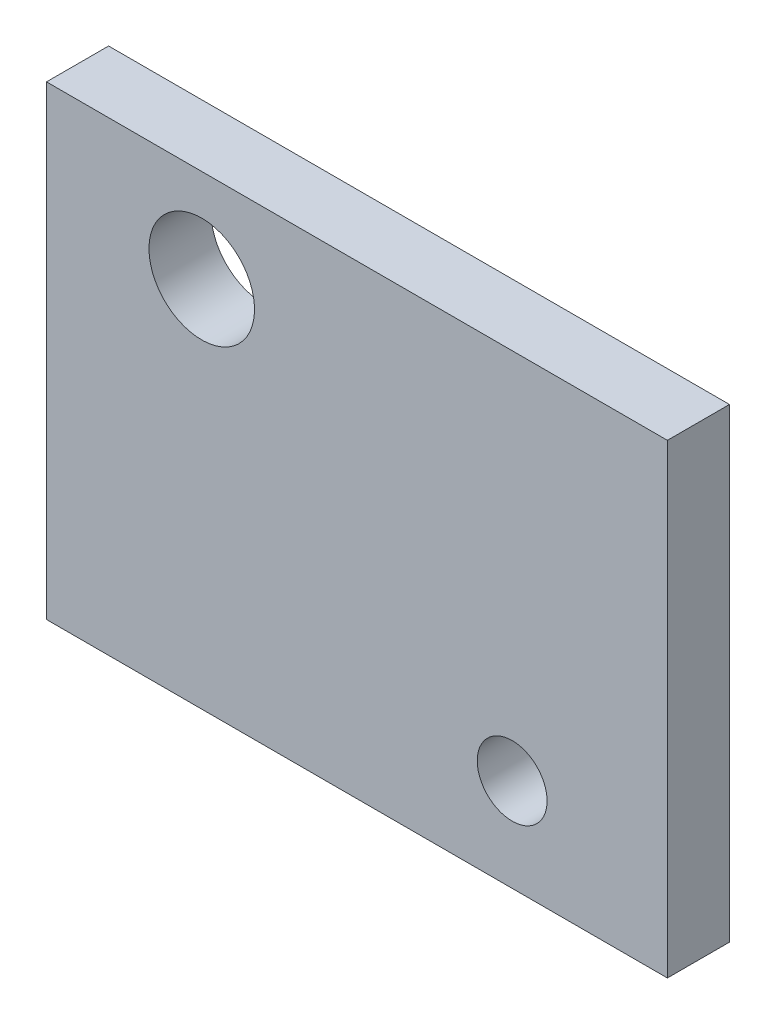
ISO-10303-21;
HEADER;
FILE_DESCRIPTION(('STEP AP214'),'2;1');
FILE_NAME('part.step','',(''),(''),'','','');
FILE_SCHEMA(('AUTOMOTIVE_DESIGN { 1 0 10303 214 1 1 1 1 }'));
ENDSEC;
DATA;
#1=APPLICATION_CONTEXT('core data for automotive mechanical design processes');
#2=APPLICATION_PROTOCOL_DEFINITION('international standard','automotive_design',2000,#1);
#3=PRODUCT_CONTEXT('',#1,'mechanical');
#4=PRODUCT('Part','Part','',(#3));
#5=PRODUCT_RELATED_PRODUCT_CATEGORY('part','',(#4));
#6=PRODUCT_DEFINITION_FORMATION('','',#4);
#7=PRODUCT_DEFINITION_CONTEXT('part definition',#1,'design');
#8=PRODUCT_DEFINITION('design','',#6,#7);
#9=PRODUCT_DEFINITION_SHAPE('','',#8);
#10=(LENGTH_UNIT() NAMED_UNIT(*) SI_UNIT(.MILLI.,.METRE.));
#11=(NAMED_UNIT(*) PLANE_ANGLE_UNIT() SI_UNIT($,.RADIAN.));
#12=(NAMED_UNIT(*) SI_UNIT($,.STERADIAN.) SOLID_ANGLE_UNIT());
#13=UNCERTAINTY_MEASURE_WITH_UNIT(LENGTH_MEASURE(1.E-05),#10,'distance_accuracy_value','');
#14=(GEOMETRIC_REPRESENTATION_CONTEXT(3) GLOBAL_UNCERTAINTY_ASSIGNED_CONTEXT((#13)) GLOBAL_UNIT_ASSIGNED_CONTEXT((#10,
#11,#12)) REPRESENTATION_CONTEXT('',''));
#15=CARTESIAN_POINT('',(0.,0.,0.));
#16=DIRECTION('',(0.,0.,1.));
#17=DIRECTION('',(1.,0.,0.));
#18=AXIS2_PLACEMENT_3D('',#15,#16,#17);
#19=CARTESIAN_POINT('',(100.,-75.,20.));
#20=DIRECTION('',(-1.,0.,0.));
#21=DIRECTION('',(0.,0.,1.));
#22=AXIS2_PLACEMENT_3D('',#19,#20,#21);
#23=PLANE('',#22);
#24=DIRECTION('',(0.,1.,0.));
#25=VECTOR('',#24,1.);
#26=CARTESIAN_POINT('',(100.,-75.,0.));
#27=LINE('',#26,#25);
#28=CARTESIAN_POINT('',(100.,-75.,0.));
#29=VERTEX_POINT('',#28);
#30=CARTESIAN_POINT('',(100.,75.,0.));
#31=VERTEX_POINT('',#30);
#32=EDGE_CURVE('E96',#29,#31,#27,.T.);
#33=ORIENTED_EDGE('',*,*,#32,.T.);
#34=DIRECTION('',(0.,0.,-1.));
#35=VECTOR('',#34,1.);
#36=CARTESIAN_POINT('',(100.,75.,20.));
#37=LINE('',#36,#35);
#38=CARTESIAN_POINT('',(100.,75.,20.));
#39=VERTEX_POINT('',#38);
#40=EDGE_CURVE('E11',#39,#31,#37,.T.);
#41=ORIENTED_EDGE('',*,*,#40,.F.);
#42=DIRECTION('',(0.,1.,0.));
#43=VECTOR('',#42,1.);
#44=CARTESIAN_POINT('',(100.,-75.,20.));
#45=LINE('',#44,#43);
#46=CARTESIAN_POINT('',(100.,-75.,20.));
#47=VERTEX_POINT('',#46);
#48=EDGE_CURVE('E84',#47,#39,#45,.T.);
#49=ORIENTED_EDGE('',*,*,#48,.F.);
#50=DIRECTION('',(0.,0.,-1.));
#51=VECTOR('',#50,1.);
#52=CARTESIAN_POINT('',(100.,-75.,20.));
#53=LINE('',#52,#51);
#54=EDGE_CURVE('E92',#47,#29,#53,.T.);
#55=ORIENTED_EDGE('',*,*,#54,.T.);
#56=EDGE_LOOP('',(#33,#41,#49,#55));
#57=FACE_BOUND('',#56,.T.);
#58=ADVANCED_FACE('F33',(#57),#23,.F.);
#59=CARTESIAN_POINT('',(-100.,75.,20.));
#60=DIRECTION('',(0.,-1.,0.));
#61=DIRECTION('',(0.,0.,-1.));
#62=AXIS2_PLACEMENT_3D('',#59,#60,#61);
#63=PLANE('',#62);
#64=DIRECTION('',(-1.,0.,0.));
#65=VECTOR('',#64,1.);
#66=CARTESIAN_POINT('',(-100.,75.,0.));
#67=LINE('',#66,#65);
#68=CARTESIAN_POINT('',(-100.,75.,0.));
#69=VERTEX_POINT('',#68);
#70=EDGE_CURVE('E88',#31,#69,#67,.T.);
#71=ORIENTED_EDGE('',*,*,#70,.T.);
#72=DIRECTION('',(0.,0.,-1.));
#73=VECTOR('',#72,1.);
#74=CARTESIAN_POINT('',(-100.,75.,20.));
#75=LINE('',#74,#73);
#76=CARTESIAN_POINT('',(-100.,75.,20.));
#77=VERTEX_POINT('',#76);
#78=EDGE_CURVE('E41',#77,#69,#75,.T.);
#79=ORIENTED_EDGE('',*,*,#78,.F.);
#80=DIRECTION('',(-1.,0.,0.));
#81=VECTOR('',#80,1.);
#82=CARTESIAN_POINT('',(-100.,75.,20.));
#83=LINE('',#82,#81);
#84=EDGE_CURVE('E79',#39,#77,#83,.T.);
#85=ORIENTED_EDGE('',*,*,#84,.F.);
#86=ORIENTED_EDGE('',*,*,#40,.T.);
#87=EDGE_LOOP('',(#71,#79,#85,#86));
#88=FACE_BOUND('',#87,.T.);
#89=ADVANCED_FACE('F87',(#88),#63,.F.);
#90=CARTESIAN_POINT('',(-100.,-75.,20.));
#91=DIRECTION('',(1.,0.,0.));
#92=DIRECTION('',(0.,0.,-1.));
#93=AXIS2_PLACEMENT_3D('',#90,#91,#92);
#94=PLANE('',#93);
#95=DIRECTION('',(0.,-1.,0.));
#96=VECTOR('',#95,1.);
#97=CARTESIAN_POINT('',(-100.,-75.,0.));
#98=LINE('',#97,#96);
#99=CARTESIAN_POINT('',(-100.,-75.,0.));
#100=VERTEX_POINT('',#99);
#101=EDGE_CURVE('E66',#69,#100,#98,.T.);
#102=ORIENTED_EDGE('',*,*,#101,.T.);
#103=DIRECTION('',(0.,0.,-1.));
#104=VECTOR('',#103,1.);
#105=CARTESIAN_POINT('',(-100.,-75.,20.));
#106=LINE('',#105,#104);
#107=CARTESIAN_POINT('',(-100.,-75.,20.));
#108=VERTEX_POINT('',#107);
#109=EDGE_CURVE('E89',#108,#100,#106,.T.);
#110=ORIENTED_EDGE('',*,*,#109,.F.);
#111=DIRECTION('',(0.,-1.,0.));
#112=VECTOR('',#111,1.);
#113=CARTESIAN_POINT('',(-100.,-75.,20.));
#114=LINE('',#113,#112);
#115=EDGE_CURVE('E82',#77,#108,#114,.T.);
#116=ORIENTED_EDGE('',*,*,#115,.F.);
#117=ORIENTED_EDGE('',*,*,#78,.T.);
#118=EDGE_LOOP('',(#102,#110,#116,#117));
#119=FACE_BOUND('',#118,.T.);
#120=ADVANCED_FACE('F90',(#119),#94,.F.);
#121=CARTESIAN_POINT('',(-100.,-75.,20.));
#122=DIRECTION('',(0.,1.,0.));
#123=DIRECTION('',(0.,0.,1.));
#124=AXIS2_PLACEMENT_3D('',#121,#122,#123);
#125=PLANE('',#124);
#126=DIRECTION('',(1.,0.,0.));
#127=VECTOR('',#126,1.);
#128=CARTESIAN_POINT('',(-100.,-75.,0.));
#129=LINE('',#128,#127);
#130=EDGE_CURVE('E72',#100,#29,#129,.T.);
#131=ORIENTED_EDGE('',*,*,#130,.T.);
#132=ORIENTED_EDGE('',*,*,#54,.F.);
#133=DIRECTION('',(1.,0.,0.));
#134=VECTOR('',#133,1.);
#135=CARTESIAN_POINT('',(-100.,-75.,20.));
#136=LINE('',#135,#134);
#137=EDGE_CURVE('E49',#108,#47,#136,.T.);
#138=ORIENTED_EDGE('',*,*,#137,.F.);
#139=ORIENTED_EDGE('',*,*,#109,.T.);
#140=EDGE_LOOP('',(#131,#132,#138,#139));
#141=FACE_BOUND('',#140,.T.);
#142=ADVANCED_FACE('F104',(#141),#125,.F.);
#143=CARTESIAN_POINT('',(0.,0.,20.));
#144=DIRECTION('',(0.,0.,-1.));
#145=DIRECTION('',(-1.,0.,0.));
#146=AXIS2_PLACEMENT_3D('',#143,#144,#145);
#147=PLANE('',#146);
#148=CARTESIAN_POINT('',(50.,-45.,20.));
#149=DIRECTION('',(0.,0.,-1.));
#150=DIRECTION('',(-1.,0.,0.));
#151=AXIS2_PLACEMENT_3D('',#148,#149,#150);
#152=CIRCLE('',#151,11.25);
#153=CARTESIAN_POINT('',(38.75,-45.,20.));
#154=VERTEX_POINT('',#153);
#155=EDGE_CURVE('E99',#154,#154,#152,.T.);
#156=ORIENTED_EDGE('',*,*,#155,.T.);
#157=EDGE_LOOP('',(#156));
#158=FACE_BOUND('',#157,.T.);
#159=CARTESIAN_POINT('',(-50.,45.,20.));
#160=DIRECTION('',(0.,0.,-1.));
#161=DIRECTION('',(-1.,0.,0.));
#162=AXIS2_PLACEMENT_3D('',#159,#160,#161);
#163=CIRCLE('',#162,17.);
#164=CARTESIAN_POINT('',(-66.9999999999999,45.,20.));
#165=VERTEX_POINT('',#164);
#166=EDGE_CURVE('E113',#165,#165,#163,.T.);
#167=ORIENTED_EDGE('',*,*,#166,.T.);
#168=EDGE_LOOP('',(#167));
#169=FACE_BOUND('',#168,.T.);
#170=ORIENTED_EDGE('',*,*,#48,.T.);
#171=ORIENTED_EDGE('',*,*,#84,.T.);
#172=ORIENTED_EDGE('',*,*,#115,.T.);
#173=ORIENTED_EDGE('',*,*,#137,.T.);
#174=EDGE_LOOP('',(#170,#171,#172,#173));
#175=FACE_BOUND('',#174,.T.);
#176=ADVANCED_FACE('F80',(#158,#169,#175),#147,.F.);
#177=CARTESIAN_POINT('',(0.,0.,0.));
#178=DIRECTION('',(0.,0.,-1.));
#179=DIRECTION('',(-1.,0.,0.));
#180=AXIS2_PLACEMENT_3D('',#177,#178,#179);
#181=PLANE('',#180);
#182=CARTESIAN_POINT('',(50.,-45.,0.));
#183=DIRECTION('',(0.,0.,-1.));
#184=DIRECTION('',(-1.,0.,0.));
#185=AXIS2_PLACEMENT_3D('',#182,#183,#184);
#186=CIRCLE('',#185,11.25);
#187=CARTESIAN_POINT('',(38.75,-45.,0.));
#188=VERTEX_POINT('',#187);
#189=EDGE_CURVE('E116',#188,#188,#186,.T.);
#190=ORIENTED_EDGE('',*,*,#189,.F.);
#191=EDGE_LOOP('',(#190));
#192=FACE_BOUND('',#191,.T.);
#193=CARTESIAN_POINT('',(-50.,45.,0.));
#194=DIRECTION('',(0.,0.,-1.));
#195=DIRECTION('',(-1.,0.,0.));
#196=AXIS2_PLACEMENT_3D('',#193,#194,#195);
#197=CIRCLE('',#196,17.);
#198=CARTESIAN_POINT('',(-66.9999999999999,45.,0.));
#199=VERTEX_POINT('',#198);
#200=EDGE_CURVE('E110',#199,#199,#197,.T.);
#201=ORIENTED_EDGE('',*,*,#200,.F.);
#202=EDGE_LOOP('',(#201));
#203=FACE_BOUND('',#202,.T.);
#204=ORIENTED_EDGE('',*,*,#32,.F.);
#205=ORIENTED_EDGE('',*,*,#130,.F.);
#206=ORIENTED_EDGE('',*,*,#101,.F.);
#207=ORIENTED_EDGE('',*,*,#70,.F.);
#208=EDGE_LOOP('',(#204,#205,#206,#207));
#209=FACE_BOUND('',#208,.T.);
#210=ADVANCED_FACE('F107',(#192,#203,#209),#181,.T.);
#211=CARTESIAN_POINT('',(-50.,45.,20.));
#212=DIRECTION('',(0.,0.,-1.));
#213=DIRECTION('',(-1.,0.,0.));
#214=AXIS2_PLACEMENT_3D('',#211,#212,#213);
#215=CYLINDRICAL_SURFACE('',#214,17.);
#216=ORIENTED_EDGE('',*,*,#166,.F.);
#217=EDGE_LOOP('',(#216));
#218=FACE_BOUND('',#217,.T.);
#219=ORIENTED_EDGE('',*,*,#200,.T.);
#220=EDGE_LOOP('',(#219));
#221=FACE_BOUND('',#220,.T.);
#222=ADVANCED_FACE('F127',(#218,#221),#215,.F.);
#223=CARTESIAN_POINT('',(50.,-45.,20.));
#224=DIRECTION('',(0.,0.,-1.));
#225=DIRECTION('',(-1.,0.,0.));
#226=AXIS2_PLACEMENT_3D('',#223,#224,#225);
#227=CYLINDRICAL_SURFACE('',#226,11.25);
#228=ORIENTED_EDGE('',*,*,#155,.F.);
#229=EDGE_LOOP('',(#228));
#230=FACE_BOUND('',#229,.T.);
#231=ORIENTED_EDGE('',*,*,#189,.T.);
#232=EDGE_LOOP('',(#231));
#233=FACE_BOUND('',#232,.T.);
#234=ADVANCED_FACE('F124',(#230,#233),#227,.F.);
#235=CLOSED_SHELL('',(#58,#89,#120,#142,#176,#210,#222,#234));
#236=MANIFOLD_SOLID_BREP('B2',#235);
#237=ADVANCED_BREP_SHAPE_REPRESENTATION('',(#18,#236),#14);
#238=SHAPE_DEFINITION_REPRESENTATION(#9,#237);
ENDSEC;
END-ISO-10303-21;
